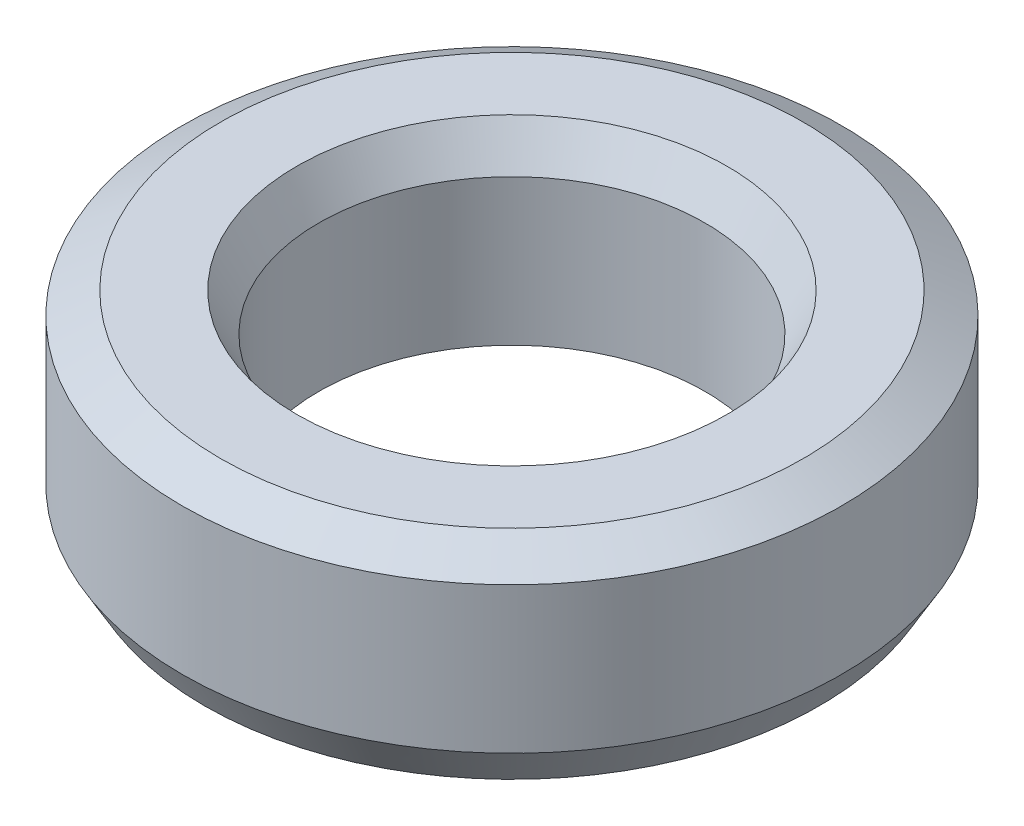
ISO-10303-21;
HEADER;
FILE_DESCRIPTION(('STEP AP214'),'2;1');
FILE_NAME('part.step','',(''),(''),'','','');
FILE_SCHEMA(('AUTOMOTIVE_DESIGN { 1 0 10303 214 1 1 1 1 }'));
ENDSEC;
DATA;
#1=APPLICATION_CONTEXT('core data for automotive mechanical design processes');
#2=APPLICATION_PROTOCOL_DEFINITION('international standard','automotive_design',2000,#1);
#3=PRODUCT_CONTEXT('',#1,'mechanical');
#4=PRODUCT('Part','Part','',(#3));
#5=PRODUCT_RELATED_PRODUCT_CATEGORY('part','',(#4));
#6=PRODUCT_DEFINITION_FORMATION('','',#4);
#7=PRODUCT_DEFINITION_CONTEXT('part definition',#1,'design');
#8=PRODUCT_DEFINITION('design','',#6,#7);
#9=PRODUCT_DEFINITION_SHAPE('','',#8);
#10=(LENGTH_UNIT() NAMED_UNIT(*) SI_UNIT(.MILLI.,.METRE.));
#11=(NAMED_UNIT(*) PLANE_ANGLE_UNIT() SI_UNIT($,.RADIAN.));
#12=(NAMED_UNIT(*) SI_UNIT($,.STERADIAN.) SOLID_ANGLE_UNIT());
#13=UNCERTAINTY_MEASURE_WITH_UNIT(LENGTH_MEASURE(1.E-05),#10,'distance_accuracy_value','');
#14=(GEOMETRIC_REPRESENTATION_CONTEXT(3) GLOBAL_UNCERTAINTY_ASSIGNED_CONTEXT((#13)) GLOBAL_UNIT_ASSIGNED_CONTEXT((#10,
#11,#12)) REPRESENTATION_CONTEXT('',''));
#15=CARTESIAN_POINT('',(0.,0.,0.));
#16=DIRECTION('',(0.,0.,1.));
#17=DIRECTION('',(1.,0.,0.));
#18=AXIS2_PLACEMENT_3D('',#15,#16,#17);
#19=CARTESIAN_POINT('',(0.,34.3917377286053,0.));
#20=DIRECTION('',(0.,-1.,0.));
#21=DIRECTION('',(0.,0.,-1.));
#22=AXIS2_PLACEMENT_3D('',#19,#20,#21);
#23=CYLINDRICAL_SURFACE('',#22,55.);
#24=CARTESIAN_POINT('',(0.,6.3629100843399,0.));
#25=DIRECTION('',(0.,1.,0.));
#26=DIRECTION('',(0.,0.,1.));
#27=AXIS2_PLACEMENT_3D('',#24,#25,#26);
#28=CIRCLE('',#27,55.);
#29=CARTESIAN_POINT('',(0.,6.3629100843399,55.));
#30=VERTEX_POINT('',#29);
#31=EDGE_CURVE('E10',#30,#30,#28,.T.);
#32=ORIENTED_EDGE('',*,*,#31,.T.);
#33=EDGE_LOOP('',(#32));
#34=FACE_BOUND('',#33,.T.);
#35=CARTESIAN_POINT('',(0.,30.7181098785822,0.));
#36=DIRECTION('',(0.,1.,0.));
#37=DIRECTION('',(0.,0.,1.));
#38=AXIS2_PLACEMENT_3D('',#35,#36,#37);
#39=CIRCLE('',#38,55.);
#40=CARTESIAN_POINT('',(0.,30.7181098785822,55.));
#41=VERTEX_POINT('',#40);
#42=EDGE_CURVE('E50',#41,#41,#39,.F.);
#43=ORIENTED_EDGE('',*,*,#42,.T.);
#44=EDGE_LOOP('',(#43));
#45=FACE_BOUND('',#44,.T.);
#46=ADVANCED_FACE('F39',(#34,#45),#23,.T.);
#47=CARTESIAN_POINT('',(0.,34.3917377286053,0.));
#48=DIRECTION('',(0.,1.,0.));
#49=DIRECTION('',(0.,0.,1.));
#50=AXIS2_PLACEMENT_3D('',#47,#48,#49);
#51=PLANE('',#50);
#52=CARTESIAN_POINT('',(0.,34.3917377286053,0.));
#53=DIRECTION('',(0.,1.,0.));
#54=DIRECTION('',(0.,0.,1.));
#55=AXIS2_PLACEMENT_3D('',#52,#53,#54);
#56=CIRCLE('',#55,35.8984585810081);
#57=CARTESIAN_POINT('',(0.,34.3917377286053,35.8984585810081));
#58=VERTEX_POINT('',#57);
#59=EDGE_CURVE('E58',#58,#58,#56,.F.);
#60=ORIENTED_EDGE('',*,*,#59,.T.);
#61=EDGE_LOOP('',(#60));
#62=FACE_BOUND('',#61,.T.);
#63=CARTESIAN_POINT('',(0.,34.3917377286053,0.));
#64=DIRECTION('',(0.,1.,0.));
#65=DIRECTION('',(0.,0.,1.));
#66=AXIS2_PLACEMENT_3D('',#63,#64,#65);
#67=CIRCLE('',#66,48.6370899156601);
#68=CARTESIAN_POINT('',(0.,34.3917377286053,48.6370899156601));
#69=VERTEX_POINT('',#68);
#70=EDGE_CURVE('E61',#69,#69,#67,.T.);
#71=ORIENTED_EDGE('',*,*,#70,.T.);
#72=EDGE_LOOP('',(#71));
#73=FACE_BOUND('',#72,.T.);
#74=ADVANCED_FACE('F88',(#62,#73),#51,.T.);
#75=CARTESIAN_POINT('',(0.,0.,0.));
#76=DIRECTION('',(0.,1.,0.));
#77=DIRECTION('',(0.,0.,1.));
#78=AXIS2_PLACEMENT_3D('',#75,#76,#77);
#79=PLANE('',#78);
#80=CARTESIAN_POINT('',(0.,0.,0.));
#81=DIRECTION('',(0.,1.,0.));
#82=DIRECTION('',(0.,0.,1.));
#83=AXIS2_PLACEMENT_3D('',#80,#81,#82);
#84=CIRCLE('',#83,38.587740815325);
#85=CARTESIAN_POINT('',(0.,0.,38.587740815325));
#86=VERTEX_POINT('',#85);
#87=EDGE_CURVE('E51',#86,#86,#84,.T.);
#88=ORIENTED_EDGE('',*,*,#87,.T.);
#89=EDGE_LOOP('',(#88));
#90=FACE_BOUND('',#89,.T.);
#91=CARTESIAN_POINT('',(0.,0.,0.));
#92=DIRECTION('',(0.,1.,0.));
#93=DIRECTION('',(0.,0.,1.));
#94=AXIS2_PLACEMENT_3D('',#91,#92,#93);
#95=CIRCLE('',#94,51.3263721499769);
#96=CARTESIAN_POINT('',(0.,0.,51.3263721499769));
#97=VERTEX_POINT('',#96);
#98=EDGE_CURVE('E54',#97,#97,#95,.F.);
#99=ORIENTED_EDGE('',*,*,#98,.T.);
#100=EDGE_LOOP('',(#99));
#101=FACE_BOUND('',#100,.T.);
#102=ADVANCED_FACE('F83',(#90,#101),#79,.F.);
#103=CARTESIAN_POINT('',(0.,34.3917377286053,0.));
#104=DIRECTION('',(0.,-1.,0.));
#105=DIRECTION('',(0.,0.,-1.));
#106=AXIS2_PLACEMENT_3D('',#103,#104,#105);
#107=CYLINDRICAL_SURFACE('',#106,32.2248307309851);
#108=CARTESIAN_POINT('',(0.,28.0288276442654,0.));
#109=DIRECTION('',(0.,1.,0.));
#110=DIRECTION('',(0.,0.,1.));
#111=AXIS2_PLACEMENT_3D('',#108,#109,#110);
#112=CIRCLE('',#111,32.2248307309851);
#113=CARTESIAN_POINT('',(0.,28.0288276442654,32.2248307309851));
#114=VERTEX_POINT('',#113);
#115=EDGE_CURVE('E67',#114,#114,#112,.T.);
#116=ORIENTED_EDGE('',*,*,#115,.T.);
#117=EDGE_LOOP('',(#116));
#118=FACE_BOUND('',#117,.T.);
#119=CARTESIAN_POINT('',(0.,3.67362785002306,0.));
#120=DIRECTION('',(0.,1.,0.));
#121=DIRECTION('',(0.,0.,1.));
#122=AXIS2_PLACEMENT_3D('',#119,#120,#121);
#123=CIRCLE('',#122,32.2248307309851);
#124=CARTESIAN_POINT('',(0.,3.67362785002306,32.2248307309851));
#125=VERTEX_POINT('',#124);
#126=EDGE_CURVE('E69',#125,#125,#123,.F.);
#127=ORIENTED_EDGE('',*,*,#126,.T.);
#128=EDGE_LOOP('',(#127));
#129=FACE_BOUND('',#128,.T.);
#130=ADVANCED_FACE('F71',(#118,#129),#107,.F.);
#131=CARTESIAN_POINT('',(0.,28.0288276442654,0.));
#132=DIRECTION('',(0.,1.,0.));
#133=DIRECTION('',(0.,0.,1.));
#134=AXIS2_PLACEMENT_3D('',#131,#132,#133);
#135=CONICAL_SURFACE('',#134,32.2248307309851,0.523598775598303);
#136=ORIENTED_EDGE('',*,*,#59,.F.);
#137=EDGE_LOOP('',(#136));
#138=FACE_BOUND('',#137,.T.);
#139=ORIENTED_EDGE('',*,*,#115,.F.);
#140=EDGE_LOOP('',(#139));
#141=FACE_BOUND('',#140,.T.);
#142=ADVANCED_FACE('F77',(#138,#141),#135,.F.);
#143=CARTESIAN_POINT('',(0.,0.,0.));
#144=DIRECTION('',(0.,-1.,0.));
#145=DIRECTION('',(0.,0.,-1.));
#146=AXIS2_PLACEMENT_3D('',#143,#144,#145);
#147=CONICAL_SURFACE('',#146,38.587740815325,1.04719755119659);
#148=ORIENTED_EDGE('',*,*,#126,.F.);
#149=EDGE_LOOP('',(#148));
#150=FACE_BOUND('',#149,.T.);
#151=ORIENTED_EDGE('',*,*,#87,.F.);
#152=EDGE_LOOP('',(#151));
#153=FACE_BOUND('',#152,.T.);
#154=ADVANCED_FACE('F73',(#150,#153),#147,.F.);
#155=CARTESIAN_POINT('',(0.,6.3629100843399,0.));
#156=DIRECTION('',(0.,1.,0.));
#157=DIRECTION('',(0.,0.,1.));
#158=AXIS2_PLACEMENT_3D('',#155,#156,#157);
#159=CONICAL_SURFACE('',#158,55.,0.523598775598302);
#160=ORIENTED_EDGE('',*,*,#98,.F.);
#161=EDGE_LOOP('',(#160));
#162=FACE_BOUND('',#161,.T.);
#163=ORIENTED_EDGE('',*,*,#31,.F.);
#164=EDGE_LOOP('',(#163));
#165=FACE_BOUND('',#164,.T.);
#166=ADVANCED_FACE('F76',(#162,#165),#159,.T.);
#167=CARTESIAN_POINT('',(0.,34.3917377286053,0.));
#168=DIRECTION('',(0.,-1.,0.));
#169=DIRECTION('',(0.,0.,-1.));
#170=AXIS2_PLACEMENT_3D('',#167,#168,#169);
#171=CONICAL_SURFACE('',#170,48.6370899156601,1.04719755119659);
#172=ORIENTED_EDGE('',*,*,#42,.F.);
#173=EDGE_LOOP('',(#172));
#174=FACE_BOUND('',#173,.T.);
#175=ORIENTED_EDGE('',*,*,#70,.F.);
#176=EDGE_LOOP('',(#175));
#177=FACE_BOUND('',#176,.T.);
#178=ADVANCED_FACE('F45',(#174,#177),#171,.T.);
#179=CLOSED_SHELL('',(#46,#74,#102,#130,#142,#154,#166,#178));
#180=MANIFOLD_SOLID_BREP('B2',#179);
#181=ADVANCED_BREP_SHAPE_REPRESENTATION('',(#18,#180),#14);
#182=SHAPE_DEFINITION_REPRESENTATION(#9,#181);
ENDSEC;
END-ISO-10303-21;
